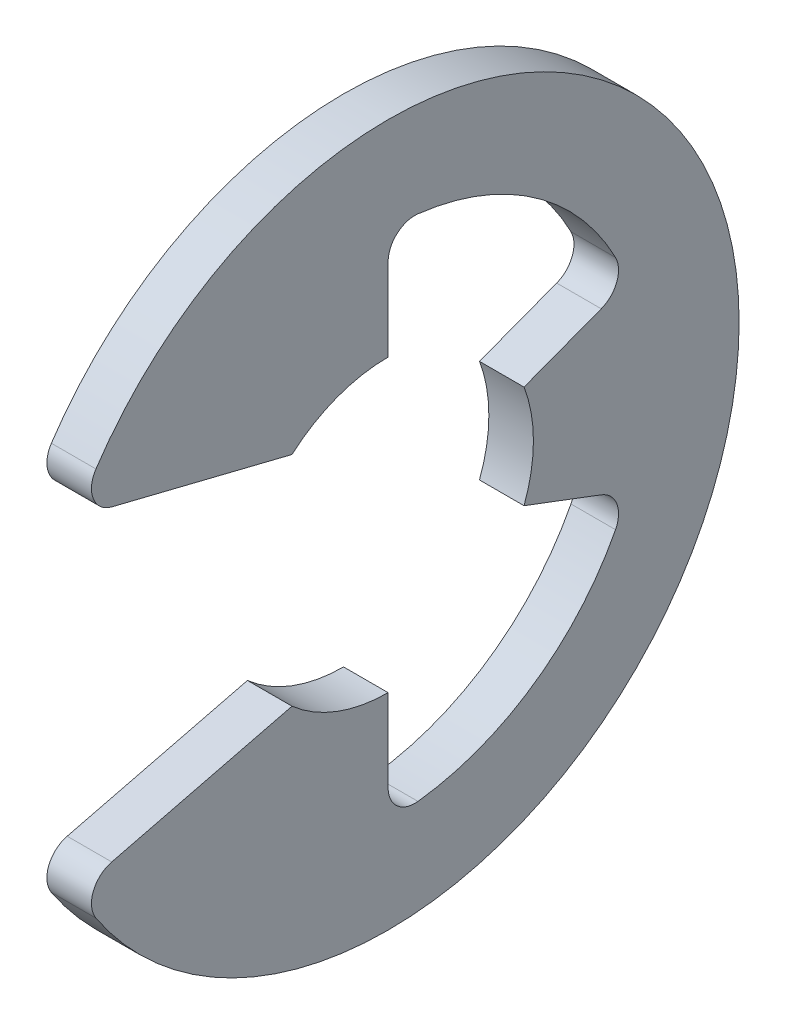
ISO-10303-21;
HEADER;
FILE_DESCRIPTION(('STEP AP214'),'2;1');
FILE_NAME('part.step','',(''),(''),'','','');
FILE_SCHEMA(('AUTOMOTIVE_DESIGN { 1 0 10303 214 1 1 1 1 }'));
ENDSEC;
DATA;
#1=APPLICATION_CONTEXT('core data for automotive mechanical design processes');
#2=APPLICATION_PROTOCOL_DEFINITION('international standard','automotive_design',2000,#1);
#3=PRODUCT_CONTEXT('',#1,'mechanical');
#4=PRODUCT('Part','Part','',(#3));
#5=PRODUCT_RELATED_PRODUCT_CATEGORY('part','',(#4));
#6=PRODUCT_DEFINITION_FORMATION('','',#4);
#7=PRODUCT_DEFINITION_CONTEXT('part definition',#1,'design');
#8=PRODUCT_DEFINITION('design','',#6,#7);
#9=PRODUCT_DEFINITION_SHAPE('','',#8);
#10=(LENGTH_UNIT() NAMED_UNIT(*) SI_UNIT(.MILLI.,.METRE.));
#11=(NAMED_UNIT(*) PLANE_ANGLE_UNIT() SI_UNIT($,.RADIAN.));
#12=(NAMED_UNIT(*) SI_UNIT($,.STERADIAN.) SOLID_ANGLE_UNIT());
#13=UNCERTAINTY_MEASURE_WITH_UNIT(LENGTH_MEASURE(1.E-05),#10,'distance_accuracy_value','');
#14=(GEOMETRIC_REPRESENTATION_CONTEXT(3) GLOBAL_UNCERTAINTY_ASSIGNED_CONTEXT((#13)) GLOBAL_UNIT_ASSIGNED_CONTEXT((#10,
#11,#12)) REPRESENTATION_CONTEXT('',''));
#15=CARTESIAN_POINT('',(0.,0.,0.));
#16=DIRECTION('',(0.,0.,1.));
#17=DIRECTION('',(1.,0.,0.));
#18=AXIS2_PLACEMENT_3D('',#15,#16,#17);
#19=CARTESIAN_POINT('',(0.5,0.,0.));
#20=DIRECTION('',(-1.,0.,0.));
#21=DIRECTION('',(0.,0.,1.));
#22=AXIS2_PLACEMENT_3D('',#19,#20,#21);
#23=CYLINDRICAL_SURFACE('',#22,7.87500000000001);
#24=CARTESIAN_POINT('',(0.5,0.,0.));
#25=DIRECTION('',(1.,0.,0.));
#26=DIRECTION('',(0.,0.,-1.));
#27=AXIS2_PLACEMENT_3D('',#24,#25,#26);
#28=CIRCLE('',#27,7.87500000000001);
#29=CARTESIAN_POINT('',(0.5,-4.36384197950054,6.55534195736186));
#30=VERTEX_POINT('',#29);
#31=CARTESIAN_POINT('',(0.5,4.36384197950054,6.55534195736186));
#32=VERTEX_POINT('',#31);
#33=EDGE_CURVE('E170',#30,#32,#28,.T.);
#34=ORIENTED_EDGE('',*,*,#33,.F.);
#35=DIRECTION('',(-1.,0.,0.));
#36=VECTOR('',#35,1.);
#37=CARTESIAN_POINT('',(0.5,-4.36384197950054,6.55534195736186));
#38=LINE('',#37,#36);
#39=CARTESIAN_POINT('',(-0.5,-4.36384197950054,6.55534195736186));
#40=VERTEX_POINT('',#39);
#41=EDGE_CURVE('E264',#30,#40,#38,.T.);
#42=ORIENTED_EDGE('',*,*,#41,.T.);
#43=CARTESIAN_POINT('',(-0.5,0.,0.));
#44=DIRECTION('',(1.,0.,0.));
#45=DIRECTION('',(0.,0.,-1.));
#46=AXIS2_PLACEMENT_3D('',#43,#44,#45);
#47=CIRCLE('',#46,7.87500000000001);
#48=CARTESIAN_POINT('',(-0.5,4.36384197950054,6.55534195736186));
#49=VERTEX_POINT('',#48);
#50=EDGE_CURVE('E208',#40,#49,#47,.T.);
#51=ORIENTED_EDGE('',*,*,#50,.T.);
#52=DIRECTION('',(-1.,0.,0.));
#53=VECTOR('',#52,1.);
#54=CARTESIAN_POINT('',(0.5,4.36384197950054,6.55534195736186));
#55=LINE('',#54,#53);
#56=EDGE_CURVE('E262',#49,#32,#55,.F.);
#57=ORIENTED_EDGE('',*,*,#56,.T.);
#58=EDGE_LOOP('',(#34,#42,#51,#57));
#59=FACE_BOUND('',#58,.T.);
#60=ADVANCED_FACE('F32',(#59),#23,.T.);
#61=CARTESIAN_POINT('',(0.5,3.64299487654465,6.98170561750276));
#62=DIRECTION('',(0.,0.970536829925373,-0.240952820606873));
#63=DIRECTION('',(0.,0.240952820606873,0.970536829925373));
#64=AXIS2_PLACEMENT_3D('',#61,#62,#63);
#65=PLANE('',#64);
#66=DIRECTION('',(0.,-0.240952820606873,-0.970536829925373));
#67=VECTOR('',#66,1.);
#68=CARTESIAN_POINT('',(0.5,3.64299487654465,6.98170561750276));
#69=LINE('',#68,#67);
#70=CARTESIAN_POINT('',(0.5,3.44903668310718,6.20045902440318));
#71=VERTEX_POINT('',#70);
#72=CARTESIAN_POINT('',(0.5,2.445,2.15628731851764));
#73=VERTEX_POINT('',#72);
#74=EDGE_CURVE('E156',#71,#73,#69,.T.);
#75=ORIENTED_EDGE('',*,*,#74,.F.);
#76=DIRECTION('',(-1.,0.,0.));
#77=VECTOR('',#76,1.);
#78=CARTESIAN_POINT('',(0.5,3.44903668310718,6.20045902440318));
#79=LINE('',#78,#77);
#80=CARTESIAN_POINT('',(-0.5,3.44903668310718,6.20045902440318));
#81=VERTEX_POINT('',#80);
#82=EDGE_CURVE('E276',#71,#81,#79,.T.);
#83=ORIENTED_EDGE('',*,*,#82,.T.);
#84=DIRECTION('',(0.,-0.240952820606873,-0.970536829925373));
#85=VECTOR('',#84,1.);
#86=CARTESIAN_POINT('',(-0.5,3.64299487654465,6.98170561750276));
#87=LINE('',#86,#85);
#88=CARTESIAN_POINT('',(-0.5,2.445,2.15628731851764));
#89=VERTEX_POINT('',#88);
#90=EDGE_CURVE('E176',#81,#89,#87,.T.);
#91=ORIENTED_EDGE('',*,*,#90,.T.);
#92=DIRECTION('',(-1.,0.,0.));
#93=VECTOR('',#92,1.);
#94=CARTESIAN_POINT('',(0.5,2.445,2.15628731851764));
#95=LINE('',#94,#93);
#96=EDGE_CURVE('E173',#73,#89,#95,.T.);
#97=ORIENTED_EDGE('',*,*,#96,.F.);
#98=EDGE_LOOP('',(#75,#83,#91,#97));
#99=FACE_BOUND('',#98,.T.);
#100=ADVANCED_FACE('F174',(#99),#65,.F.);
#101=CARTESIAN_POINT('',(0.5,0.,0.));
#102=DIRECTION('',(-1.,0.,0.));
#103=DIRECTION('',(0.,0.,1.));
#104=AXIS2_PLACEMENT_3D('',#101,#102,#103);
#105=CYLINDRICAL_SURFACE('',#104,3.26);
#106=CARTESIAN_POINT('',(-0.5,0.,0.));
#107=DIRECTION('',(-1.,0.,0.));
#108=DIRECTION('',(0.,0.,1.));
#109=AXIS2_PLACEMENT_3D('',#106,#107,#108);
#110=CIRCLE('',#109,3.26);
#111=CARTESIAN_POINT('',(-0.5,3.26,0.));
#112=VERTEX_POINT('',#111);
#113=EDGE_CURVE('E212',#89,#112,#110,.T.);
#114=ORIENTED_EDGE('',*,*,#113,.T.);
#115=DIRECTION('',(-1.,0.,0.));
#116=VECTOR('',#115,1.);
#117=CARTESIAN_POINT('',(0.5,3.26,0.));
#118=LINE('',#117,#116);
#119=CARTESIAN_POINT('',(0.5,3.26,0.));
#120=VERTEX_POINT('',#119);
#121=EDGE_CURVE('E180',#120,#112,#118,.T.);
#122=ORIENTED_EDGE('',*,*,#121,.F.);
#123=CARTESIAN_POINT('',(0.5,0.,0.));
#124=DIRECTION('',(-1.,0.,0.));
#125=DIRECTION('',(0.,0.,1.));
#126=AXIS2_PLACEMENT_3D('',#123,#124,#125);
#127=CIRCLE('',#126,3.26);
#128=EDGE_CURVE('E162',#73,#120,#127,.T.);
#129=ORIENTED_EDGE('',*,*,#128,.F.);
#130=ORIENTED_EDGE('',*,*,#96,.T.);
#131=EDGE_LOOP('',(#114,#122,#129,#130));
#132=FACE_BOUND('',#131,.T.);
#133=ADVANCED_FACE('F182',(#132),#105,.F.);
#134=CARTESIAN_POINT('',(0.5,3.26,0.));
#135=DIRECTION('',(0.,0.,1.));
#136=DIRECTION('',(0.,-1.,0.));
#137=AXIS2_PLACEMENT_3D('',#134,#135,#136);
#138=PLANE('',#137);
#139=DIRECTION('',(0.,1.,0.));
#140=VECTOR('',#139,1.);
#141=CARTESIAN_POINT('',(-0.5,3.26,0.));
#142=LINE('',#141,#140);
#143=CARTESIAN_POINT('',(-0.5,5.11200598619697,0.));
#144=VERTEX_POINT('',#143);
#145=EDGE_CURVE('E214',#112,#144,#142,.T.);
#146=ORIENTED_EDGE('',*,*,#145,.T.);
#147=DIRECTION('',(1.,0.,0.));
#148=VECTOR('',#147,1.);
#149=CARTESIAN_POINT('',(0.5,5.11200598619697,0.));
#150=LINE('',#149,#148);
#151=CARTESIAN_POINT('',(0.5,5.11200598619697,0.));
#152=VERTEX_POINT('',#151);
#153=EDGE_CURVE('E260',#144,#152,#150,.T.);
#154=ORIENTED_EDGE('',*,*,#153,.T.);
#155=DIRECTION('',(0.,1.,0.));
#156=VECTOR('',#155,1.);
#157=CARTESIAN_POINT('',(0.5,3.26,0.));
#158=LINE('',#157,#156);
#159=EDGE_CURVE('E185',#120,#152,#158,.T.);
#160=ORIENTED_EDGE('',*,*,#159,.F.);
#161=ORIENTED_EDGE('',*,*,#121,.T.);
#162=EDGE_LOOP('',(#146,#154,#160,#161));
#163=FACE_BOUND('',#162,.T.);
#164=ADVANCED_FACE('F382',(#163),#138,.F.);
#165=CARTESIAN_POINT('',(0.5,0.,0.));
#166=DIRECTION('',(-1.,0.,0.));
#167=DIRECTION('',(0.,0.,1.));
#168=AXIS2_PLACEMENT_3D('',#165,#166,#167);
#169=CYLINDRICAL_SURFACE('',#168,5.74709677419355);
#170=CARTESIAN_POINT('',(0.5,0.,0.));
#171=DIRECTION('',(-1.,0.,0.));
#172=DIRECTION('',(0.,0.,-1.));
#173=AXIS2_PLACEMENT_3D('',#170,#171,#172);
#174=CIRCLE('',#173,5.74709677419355);
#175=CARTESIAN_POINT('',(0.5,5.70791543307127,-0.669942341438955));
#176=VERTEX_POINT('',#175);
#177=CARTESIAN_POINT('',(0.5,2.64472653222145,-5.10240559949028));
#178=VERTEX_POINT('',#177);
#179=EDGE_CURVE('E187',#176,#178,#174,.T.);
#180=ORIENTED_EDGE('',*,*,#179,.F.);
#181=DIRECTION('',(-1.,0.,0.));
#182=VECTOR('',#181,1.);
#183=CARTESIAN_POINT('',(0.5,5.70791543307127,-0.669942341438955));
#184=LINE('',#183,#182);
#185=CARTESIAN_POINT('',(-0.5,5.70791543307127,-0.669942341438955));
#186=VERTEX_POINT('',#185);
#187=EDGE_CURVE('E257',#176,#186,#184,.T.);
#188=ORIENTED_EDGE('',*,*,#187,.T.);
#189=CARTESIAN_POINT('',(-0.5,0.,0.));
#190=DIRECTION('',(-1.,0.,0.));
#191=DIRECTION('',(0.,0.,-1.));
#192=AXIS2_PLACEMENT_3D('',#189,#190,#191);
#193=CIRCLE('',#192,5.74709677419355);
#194=CARTESIAN_POINT('',(-0.5,2.64472653222145,-5.10240559949028));
#195=VERTEX_POINT('',#194);
#196=EDGE_CURVE('E217',#186,#195,#193,.T.);
#197=ORIENTED_EDGE('',*,*,#196,.T.);
#198=DIRECTION('',(-1.,0.,0.));
#199=VECTOR('',#198,1.);
#200=CARTESIAN_POINT('',(0.5,2.64472653222145,-5.10240559949029));
#201=LINE('',#200,#199);
#202=EDGE_CURVE('E255',#195,#178,#201,.F.);
#203=ORIENTED_EDGE('',*,*,#202,.T.);
#204=EDGE_LOOP('',(#180,#188,#197,#203));
#205=FACE_BOUND('',#204,.T.);
#206=ADVANCED_FACE('F304',(#205),#169,.F.);
#207=CARTESIAN_POINT('',(0.5,1.15258405333407,-3.04945077022076));
#208=DIRECTION('',(0.,-0.935414346693485,-0.353553390593274));
#209=DIRECTION('',(0.,0.353553390593274,-0.935414346693485));
#210=AXIS2_PLACEMENT_3D('',#207,#208,#209);
#211=PLANE('',#210);
#212=DIRECTION('',(0.,-0.353553390593274,0.935414346693485));
#213=VECTOR('',#212,1.);
#214=CARTESIAN_POINT('',(0.5,1.15258405333407,-3.04945077022076));
#215=LINE('',#214,#213);
#216=CARTESIAN_POINT('',(0.5,1.80736704915305,-4.78184373987162));
#217=VERTEX_POINT('',#216);
#218=CARTESIAN_POINT('',(0.5,1.15258405333407,-3.04945077022076));
#219=VERTEX_POINT('',#218);
#220=EDGE_CURVE('E192',#217,#219,#215,.T.);
#221=ORIENTED_EDGE('',*,*,#220,.F.);
#222=DIRECTION('',(1.,0.,0.));
#223=VECTOR('',#222,1.);
#224=CARTESIAN_POINT('',(-0.5,1.80736704915305,-4.78184373987162));
#225=LINE('',#224,#223);
#226=CARTESIAN_POINT('',(-0.5,1.80736704915305,-4.78184373987162));
#227=VERTEX_POINT('',#226);
#228=EDGE_CURVE('E279',#217,#227,#225,.F.);
#229=ORIENTED_EDGE('',*,*,#228,.T.);
#230=DIRECTION('',(0.,-0.353553390593274,0.935414346693485));
#231=VECTOR('',#230,1.);
#232=CARTESIAN_POINT('',(-0.5,1.15258405333407,-3.04945077022076));
#233=LINE('',#232,#231);
#234=CARTESIAN_POINT('',(-0.5,1.15258405333407,-3.04945077022076));
#235=VERTEX_POINT('',#234);
#236=EDGE_CURVE('E220',#227,#235,#233,.T.);
#237=ORIENTED_EDGE('',*,*,#236,.T.);
#238=DIRECTION('',(-1.,0.,0.));
#239=VECTOR('',#238,1.);
#240=CARTESIAN_POINT('',(0.5,1.15258405333407,-3.04945077022076));
#241=LINE('',#240,#239);
#242=EDGE_CURVE('E244',#219,#235,#241,.T.);
#243=ORIENTED_EDGE('',*,*,#242,.F.);
#244=EDGE_LOOP('',(#221,#229,#237,#243));
#245=FACE_BOUND('',#244,.T.);
#246=ADVANCED_FACE('F307',(#245),#211,.F.);
#247=CARTESIAN_POINT('',(0.5,0.,0.));
#248=DIRECTION('',(-1.,0.,0.));
#249=DIRECTION('',(0.,0.,1.));
#250=AXIS2_PLACEMENT_3D('',#247,#248,#249);
#251=CYLINDRICAL_SURFACE('',#250,3.26);
#252=CARTESIAN_POINT('',(-0.5,0.,0.));
#253=DIRECTION('',(-1.,0.,0.));
#254=DIRECTION('',(0.,0.,1.));
#255=AXIS2_PLACEMENT_3D('',#252,#253,#254);
#256=CIRCLE('',#255,3.26);
#257=CARTESIAN_POINT('',(-0.5,-1.15258405333407,-3.04945077022076));
#258=VERTEX_POINT('',#257);
#259=EDGE_CURVE('E222',#235,#258,#256,.T.);
#260=ORIENTED_EDGE('',*,*,#259,.T.);
#261=DIRECTION('',(-1.,0.,0.));
#262=VECTOR('',#261,1.);
#263=CARTESIAN_POINT('',(0.5,-1.15258405333407,-3.04945077022076));
#264=LINE('',#263,#262);
#265=CARTESIAN_POINT('',(0.5,-1.15258405333407,-3.04945077022076));
#266=VERTEX_POINT('',#265);
#267=EDGE_CURVE('E241',#266,#258,#264,.T.);
#268=ORIENTED_EDGE('',*,*,#267,.F.);
#269=CARTESIAN_POINT('',(0.5,0.,0.));
#270=DIRECTION('',(-1.,0.,0.));
#271=DIRECTION('',(0.,0.,1.));
#272=AXIS2_PLACEMENT_3D('',#269,#270,#271);
#273=CIRCLE('',#272,3.26);
#274=EDGE_CURVE('E194',#219,#266,#273,.T.);
#275=ORIENTED_EDGE('',*,*,#274,.F.);
#276=ORIENTED_EDGE('',*,*,#242,.T.);
#277=EDGE_LOOP('',(#260,#268,#275,#276));
#278=FACE_BOUND('',#277,.T.);
#279=ADVANCED_FACE('F313',(#278),#251,.F.);
#280=CARTESIAN_POINT('',(0.5,-1.15258405333407,-3.04945077022076));
#281=DIRECTION('',(0.,0.935414346693485,-0.353553390593274));
#282=DIRECTION('',(0.,0.353553390593274,0.935414346693485));
#283=AXIS2_PLACEMENT_3D('',#280,#281,#282);
#284=PLANE('',#283);
#285=DIRECTION('',(0.,-0.353553390593274,-0.935414346693485));
#286=VECTOR('',#285,1.);
#287=CARTESIAN_POINT('',(-0.5,-1.15258405333407,-3.04945077022076));
#288=LINE('',#287,#286);
#289=CARTESIAN_POINT('',(-0.5,-1.80736704915305,-4.78184373987162));
#290=VERTEX_POINT('',#289);
#291=EDGE_CURVE('E224',#258,#290,#288,.T.);
#292=ORIENTED_EDGE('',*,*,#291,.T.);
#293=DIRECTION('',(1.,0.,0.));
#294=VECTOR('',#293,1.);
#295=CARTESIAN_POINT('',(0.5,-1.80736704915305,-4.78184373987162));
#296=LINE('',#295,#294);
#297=CARTESIAN_POINT('',(0.5,-1.80736704915305,-4.78184373987162));
#298=VERTEX_POINT('',#297);
#299=EDGE_CURVE('E47',#290,#298,#296,.T.);
#300=ORIENTED_EDGE('',*,*,#299,.T.);
#301=DIRECTION('',(0.,-0.353553390593274,-0.935414346693485));
#302=VECTOR('',#301,1.);
#303=CARTESIAN_POINT('',(0.5,-1.15258405333407,-3.04945077022076));
#304=LINE('',#303,#302);
#305=EDGE_CURVE('E196',#266,#298,#304,.T.);
#306=ORIENTED_EDGE('',*,*,#305,.F.);
#307=ORIENTED_EDGE('',*,*,#267,.T.);
#308=EDGE_LOOP('',(#292,#300,#306,#307));
#309=FACE_BOUND('',#308,.T.);
#310=ADVANCED_FACE('F315',(#309),#284,.F.);
#311=CARTESIAN_POINT('',(0.5,0.,0.));
#312=DIRECTION('',(-1.,0.,0.));
#313=DIRECTION('',(0.,0.,1.));
#314=AXIS2_PLACEMENT_3D('',#311,#312,#313);
#315=CYLINDRICAL_SURFACE('',#314,5.74709677419355);
#316=CARTESIAN_POINT('',(-0.5,0.,0.));
#317=DIRECTION('',(-1.,0.,0.));
#318=DIRECTION('',(0.,0.,-1.));
#319=AXIS2_PLACEMENT_3D('',#316,#317,#318);
#320=CIRCLE('',#319,5.74709677419355);
#321=CARTESIAN_POINT('',(-0.5,-2.64472653222145,-5.10240559949029));
#322=VERTEX_POINT('',#321);
#323=CARTESIAN_POINT('',(-0.5,-5.70791543307127,-0.669942341438956));
#324=VERTEX_POINT('',#323);
#325=EDGE_CURVE('E226',#322,#324,#320,.T.);
#326=ORIENTED_EDGE('',*,*,#325,.T.);
#327=DIRECTION('',(-1.,0.,0.));
#328=VECTOR('',#327,1.);
#329=CARTESIAN_POINT('',(0.5,-5.70791543307127,-0.669942341438956));
#330=LINE('',#329,#328);
#331=CARTESIAN_POINT('',(0.5,-5.70791543307127,-0.669942341438956));
#332=VERTEX_POINT('',#331);
#333=EDGE_CURVE('E253',#324,#332,#330,.F.);
#334=ORIENTED_EDGE('',*,*,#333,.T.);
#335=CARTESIAN_POINT('',(0.5,0.,0.));
#336=DIRECTION('',(-1.,0.,0.));
#337=DIRECTION('',(0.,0.,-1.));
#338=AXIS2_PLACEMENT_3D('',#335,#336,#337);
#339=CIRCLE('',#338,5.74709677419355);
#340=CARTESIAN_POINT('',(0.5,-2.64472653222145,-5.10240559949029));
#341=VERTEX_POINT('',#340);
#342=EDGE_CURVE('E198',#341,#332,#339,.T.);
#343=ORIENTED_EDGE('',*,*,#342,.F.);
#344=DIRECTION('',(-1.,0.,0.));
#345=VECTOR('',#344,1.);
#346=CARTESIAN_POINT('',(0.5,-2.64472653222145,-5.10240559949029));
#347=LINE('',#346,#345);
#348=EDGE_CURVE('E250',#341,#322,#347,.T.);
#349=ORIENTED_EDGE('',*,*,#348,.T.);
#350=EDGE_LOOP('',(#326,#334,#343,#349));
#351=FACE_BOUND('',#350,.T.);
#352=ADVANCED_FACE('F317',(#351),#315,.F.);
#353=CARTESIAN_POINT('',(0.5,-3.26,0.));
#354=DIRECTION('',(0.,0.,1.));
#355=DIRECTION('',(0.,-1.,0.));
#356=AXIS2_PLACEMENT_3D('',#353,#354,#355);
#357=PLANE('',#356);
#358=DIRECTION('',(0.,1.,0.));
#359=VECTOR('',#358,1.);
#360=CARTESIAN_POINT('',(0.5,-3.26,0.));
#361=LINE('',#360,#359);
#362=CARTESIAN_POINT('',(0.5,-5.11200598619697,0.));
#363=VERTEX_POINT('',#362);
#364=CARTESIAN_POINT('',(0.5,-3.26,0.));
#365=VERTEX_POINT('',#364);
#366=EDGE_CURVE('E201',#363,#365,#361,.T.);
#367=ORIENTED_EDGE('',*,*,#366,.F.);
#368=DIRECTION('',(1.,0.,0.));
#369=VECTOR('',#368,1.);
#370=CARTESIAN_POINT('',(-0.5,-5.11200598619697,0.));
#371=LINE('',#370,#369);
#372=CARTESIAN_POINT('',(-0.5,-5.11200598619697,0.));
#373=VERTEX_POINT('',#372);
#374=EDGE_CURVE('E179',#363,#373,#371,.F.);
#375=ORIENTED_EDGE('',*,*,#374,.T.);
#376=DIRECTION('',(0.,1.,0.));
#377=VECTOR('',#376,1.);
#378=CARTESIAN_POINT('',(-0.5,-3.26,0.));
#379=LINE('',#378,#377);
#380=CARTESIAN_POINT('',(-0.5,-3.26,0.));
#381=VERTEX_POINT('',#380);
#382=EDGE_CURVE('E229',#373,#381,#379,.T.);
#383=ORIENTED_EDGE('',*,*,#382,.T.);
#384=DIRECTION('',(-1.,0.,0.));
#385=VECTOR('',#384,1.);
#386=CARTESIAN_POINT('',(0.5,-3.26,0.));
#387=LINE('',#386,#385);
#388=EDGE_CURVE('E238',#365,#381,#387,.T.);
#389=ORIENTED_EDGE('',*,*,#388,.F.);
#390=EDGE_LOOP('',(#367,#375,#383,#389));
#391=FACE_BOUND('',#390,.T.);
#392=ADVANCED_FACE('F323',(#391),#357,.F.);
#393=CARTESIAN_POINT('',(0.5,0.,0.));
#394=DIRECTION('',(-1.,0.,0.));
#395=DIRECTION('',(0.,0.,1.));
#396=AXIS2_PLACEMENT_3D('',#393,#394,#395);
#397=CYLINDRICAL_SURFACE('',#396,3.26);
#398=CARTESIAN_POINT('',(-0.5,0.,0.));
#399=DIRECTION('',(-1.,0.,0.));
#400=DIRECTION('',(0.,0.,-1.));
#401=AXIS2_PLACEMENT_3D('',#398,#399,#400);
#402=CIRCLE('',#401,3.26);
#403=CARTESIAN_POINT('',(-0.5,-2.445,2.15628731851764));
#404=VERTEX_POINT('',#403);
#405=EDGE_CURVE('E231',#381,#404,#402,.T.);
#406=ORIENTED_EDGE('',*,*,#405,.T.);
#407=DIRECTION('',(-1.,0.,0.));
#408=VECTOR('',#407,1.);
#409=CARTESIAN_POINT('',(0.5,-2.445,2.15628731851764));
#410=LINE('',#409,#408);
#411=CARTESIAN_POINT('',(0.5,-2.445,2.15628731851764));
#412=VERTEX_POINT('',#411);
#413=EDGE_CURVE('E207',#412,#404,#410,.T.);
#414=ORIENTED_EDGE('',*,*,#413,.F.);
#415=CARTESIAN_POINT('',(0.5,0.,0.));
#416=DIRECTION('',(-1.,0.,0.));
#417=DIRECTION('',(0.,0.,-1.));
#418=AXIS2_PLACEMENT_3D('',#415,#416,#417);
#419=CIRCLE('',#418,3.26);
#420=EDGE_CURVE('E203',#365,#412,#419,.T.);
#421=ORIENTED_EDGE('',*,*,#420,.F.);
#422=ORIENTED_EDGE('',*,*,#388,.T.);
#423=EDGE_LOOP('',(#406,#414,#421,#422));
#424=FACE_BOUND('',#423,.T.);
#425=ADVANCED_FACE('F372',(#424),#397,.F.);
#426=CARTESIAN_POINT('',(0.5,-3.64299487654465,6.98170561750275));
#427=DIRECTION('',(0.,-0.970536829925373,-0.240952820606873));
#428=DIRECTION('',(0.,0.240952820606873,-0.970536829925373));
#429=AXIS2_PLACEMENT_3D('',#426,#427,#428);
#430=PLANE('',#429);
#431=DIRECTION('',(0.,-0.240952820606873,0.970536829925373));
#432=VECTOR('',#431,1.);
#433=CARTESIAN_POINT('',(-0.5,-3.64299487654465,6.98170561750275));
#434=LINE('',#433,#432);
#435=CARTESIAN_POINT('',(-0.5,-3.44903668310718,6.20045902440318));
#436=VERTEX_POINT('',#435);
#437=EDGE_CURVE('E233',#404,#436,#434,.T.);
#438=ORIENTED_EDGE('',*,*,#437,.T.);
#439=DIRECTION('',(-1.,0.,0.));
#440=VECTOR('',#439,1.);
#441=CARTESIAN_POINT('',(0.5,-3.44903668310718,6.20045902440318));
#442=LINE('',#441,#440);
#443=CARTESIAN_POINT('',(0.5,-3.44903668310718,6.20045902440318));
#444=VERTEX_POINT('',#443);
#445=EDGE_CURVE('E271',#436,#444,#442,.F.);
#446=ORIENTED_EDGE('',*,*,#445,.T.);
#447=DIRECTION('',(0.,-0.240952820606873,0.970536829925373));
#448=VECTOR('',#447,1.);
#449=CARTESIAN_POINT('',(0.5,-3.64299487654465,6.98170561750275));
#450=LINE('',#449,#448);
#451=EDGE_CURVE('E205',#412,#444,#450,.T.);
#452=ORIENTED_EDGE('',*,*,#451,.F.);
#453=ORIENTED_EDGE('',*,*,#413,.T.);
#454=EDGE_LOOP('',(#438,#446,#452,#453));
#455=FACE_BOUND('',#454,.T.);
#456=ADVANCED_FACE('F414',(#455),#430,.F.);
#457=CARTESIAN_POINT('',(0.5,0.,0.));
#458=DIRECTION('',(1.,0.,0.));
#459=DIRECTION('',(0.,0.,-1.));
#460=AXIS2_PLACEMENT_3D('',#457,#458,#459);
#461=PLANE('',#460);
#462=ORIENTED_EDGE('',*,*,#451,.T.);
#463=CARTESIAN_POINT('',(0.5,-4.03135878106241,6.05588733203906));
#464=DIRECTION('',(1.,0.,0.));
#465=DIRECTION('',(0.,0.,-1.));
#466=AXIS2_PLACEMENT_3D('',#463,#464,#465);
#467=CIRCLE('',#466,0.6);
#468=EDGE_CURVE('E274',#444,#30,#467,.T.);
#469=ORIENTED_EDGE('',*,*,#468,.T.);
#470=ORIENTED_EDGE('',*,*,#33,.T.);
#471=CARTESIAN_POINT('',(0.5,4.0313587810624,6.05588733203906));
#472=DIRECTION('',(1.,0.,0.));
#473=DIRECTION('',(0.,0.,-1.));
#474=AXIS2_PLACEMENT_3D('',#471,#472,#473);
#475=CIRCLE('',#474,0.6);
#476=EDGE_CURVE('E166',#32,#71,#475,.T.);
#477=ORIENTED_EDGE('',*,*,#476,.T.);
#478=ORIENTED_EDGE('',*,*,#74,.T.);
#479=ORIENTED_EDGE('',*,*,#128,.T.);
#480=ORIENTED_EDGE('',*,*,#159,.T.);
#481=CARTESIAN_POINT('',(0.5,5.11200598619697,-0.599999999999998));
#482=DIRECTION('',(1.,0.,0.));
#483=DIRECTION('',(0.,0.,-1.));
#484=AXIS2_PLACEMENT_3D('',#481,#482,#483);
#485=CIRCLE('',#484,0.6);
#486=EDGE_CURVE('E288',#152,#176,#485,.F.);
#487=ORIENTED_EDGE('',*,*,#486,.T.);
#488=ORIENTED_EDGE('',*,*,#179,.T.);
#489=CARTESIAN_POINT('',(0.5,2.36861565716914,-4.56971170551566));
#490=DIRECTION('',(1.,0.,0.));
#491=DIRECTION('',(0.,0.,-1.));
#492=AXIS2_PLACEMENT_3D('',#489,#490,#491);
#493=CIRCLE('',#492,0.6);
#494=EDGE_CURVE('E11',#178,#217,#493,.F.);
#495=ORIENTED_EDGE('',*,*,#494,.T.);
#496=ORIENTED_EDGE('',*,*,#220,.T.);
#497=ORIENTED_EDGE('',*,*,#274,.T.);
#498=ORIENTED_EDGE('',*,*,#305,.T.);
#499=CARTESIAN_POINT('',(0.5,-2.36861565716914,-4.56971170551566));
#500=DIRECTION('',(1.,0.,0.));
#501=DIRECTION('',(0.,0.,-1.));
#502=AXIS2_PLACEMENT_3D('',#499,#500,#501);
#503=CIRCLE('',#502,0.6);
#504=EDGE_CURVE('E292',#298,#341,#503,.F.);
#505=ORIENTED_EDGE('',*,*,#504,.T.);
#506=ORIENTED_EDGE('',*,*,#342,.T.);
#507=CARTESIAN_POINT('',(0.5,-5.11200598619697,-0.599999999999999));
#508=DIRECTION('',(1.,0.,0.));
#509=DIRECTION('',(0.,0.,-1.));
#510=AXIS2_PLACEMENT_3D('',#507,#508,#509);
#511=CIRCLE('',#510,0.6);
#512=EDGE_CURVE('E284',#332,#363,#511,.F.);
#513=ORIENTED_EDGE('',*,*,#512,.T.);
#514=ORIENTED_EDGE('',*,*,#366,.T.);
#515=ORIENTED_EDGE('',*,*,#420,.T.);
#516=EDGE_LOOP('',(#462,#469,#470,#477,#478,#479,#480,#487,#488,#495,#496,#497,#498,#505,#506,
#513,#514,#515));
#517=FACE_BOUND('',#516,.T.);
#518=ADVANCED_FACE('F159',(#517),#461,.T.);
#519=CARTESIAN_POINT('',(-0.5,0.,0.));
#520=DIRECTION('',(1.,0.,0.));
#521=DIRECTION('',(0.,0.,-1.));
#522=AXIS2_PLACEMENT_3D('',#519,#520,#521);
#523=PLANE('',#522);
#524=ORIENTED_EDGE('',*,*,#50,.F.);
#525=CARTESIAN_POINT('',(-0.5,-4.03135878106241,6.05588733203906));
#526=DIRECTION('',(1.,0.,0.));
#527=DIRECTION('',(0.,0.,-1.));
#528=AXIS2_PLACEMENT_3D('',#525,#526,#527);
#529=CIRCLE('',#528,0.6);
#530=EDGE_CURVE('E269',#40,#436,#529,.F.);
#531=ORIENTED_EDGE('',*,*,#530,.T.);
#532=ORIENTED_EDGE('',*,*,#437,.F.);
#533=ORIENTED_EDGE('',*,*,#405,.F.);
#534=ORIENTED_EDGE('',*,*,#382,.F.);
#535=CARTESIAN_POINT('',(-0.5,-5.11200598619697,-0.599999999999999));
#536=DIRECTION('',(1.,0.,0.));
#537=DIRECTION('',(0.,0.,-1.));
#538=AXIS2_PLACEMENT_3D('',#535,#536,#537);
#539=CIRCLE('',#538,0.6);
#540=EDGE_CURVE('E282',#373,#324,#539,.T.);
#541=ORIENTED_EDGE('',*,*,#540,.T.);
#542=ORIENTED_EDGE('',*,*,#325,.F.);
#543=CARTESIAN_POINT('',(-0.5,-2.36861565716914,-4.56971170551566));
#544=DIRECTION('',(1.,0.,0.));
#545=DIRECTION('',(0.,0.,-1.));
#546=AXIS2_PLACEMENT_3D('',#543,#544,#545);
#547=CIRCLE('',#546,0.6);
#548=EDGE_CURVE('E290',#322,#290,#547,.T.);
#549=ORIENTED_EDGE('',*,*,#548,.T.);
#550=ORIENTED_EDGE('',*,*,#291,.F.);
#551=ORIENTED_EDGE('',*,*,#259,.F.);
#552=ORIENTED_EDGE('',*,*,#236,.F.);
#553=CARTESIAN_POINT('',(-0.5,2.36861565716914,-4.56971170551566));
#554=DIRECTION('',(1.,0.,0.));
#555=DIRECTION('',(0.,0.,-1.));
#556=AXIS2_PLACEMENT_3D('',#553,#554,#555);
#557=CIRCLE('',#556,0.6);
#558=EDGE_CURVE('E40',#227,#195,#557,.T.);
#559=ORIENTED_EDGE('',*,*,#558,.T.);
#560=ORIENTED_EDGE('',*,*,#196,.F.);
#561=CARTESIAN_POINT('',(-0.5,5.11200598619697,-0.599999999999998));
#562=DIRECTION('',(1.,0.,0.));
#563=DIRECTION('',(0.,0.,-1.));
#564=AXIS2_PLACEMENT_3D('',#561,#562,#563);
#565=CIRCLE('',#564,0.6);
#566=EDGE_CURVE('E286',#186,#144,#565,.T.);
#567=ORIENTED_EDGE('',*,*,#566,.T.);
#568=ORIENTED_EDGE('',*,*,#145,.F.);
#569=ORIENTED_EDGE('',*,*,#113,.F.);
#570=ORIENTED_EDGE('',*,*,#90,.F.);
#571=CARTESIAN_POINT('',(-0.5,4.0313587810624,6.05588733203906));
#572=DIRECTION('',(1.,0.,0.));
#573=DIRECTION('',(0.,0.,-1.));
#574=AXIS2_PLACEMENT_3D('',#571,#572,#573);
#575=CIRCLE('',#574,0.6);
#576=EDGE_CURVE('E267',#81,#49,#575,.F.);
#577=ORIENTED_EDGE('',*,*,#576,.T.);
#578=EDGE_LOOP('',(#524,#531,#532,#533,#534,#541,#542,#549,#550,#551,#552,#559,#560,#567,#568,
#569,#570,#577));
#579=FACE_BOUND('',#578,.T.);
#580=ADVANCED_FACE('F297',(#579),#523,.F.);
#581=CARTESIAN_POINT('',(0.5,-5.11200598619697,-0.599999999999999));
#582=DIRECTION('',(-1.,0.,0.));
#583=DIRECTION('',(0.,0.,1.));
#584=AXIS2_PLACEMENT_3D('',#581,#582,#583);
#585=CYLINDRICAL_SURFACE('',#584,0.6);
#586=ORIENTED_EDGE('',*,*,#512,.F.);
#587=ORIENTED_EDGE('',*,*,#333,.F.);
#588=ORIENTED_EDGE('',*,*,#540,.F.);
#589=ORIENTED_EDGE('',*,*,#374,.F.);
#590=EDGE_LOOP('',(#586,#587,#588,#589));
#591=FACE_BOUND('',#590,.T.);
#592=ADVANCED_FACE('F337',(#591),#585,.F.);
#593=CARTESIAN_POINT('',(0.5,5.11200598619697,-0.599999999999998));
#594=DIRECTION('',(-1.,0.,0.));
#595=DIRECTION('',(0.,0.,1.));
#596=AXIS2_PLACEMENT_3D('',#593,#594,#595);
#597=CYLINDRICAL_SURFACE('',#596,0.6);
#598=ORIENTED_EDGE('',*,*,#486,.F.);
#599=ORIENTED_EDGE('',*,*,#153,.F.);
#600=ORIENTED_EDGE('',*,*,#566,.F.);
#601=ORIENTED_EDGE('',*,*,#187,.F.);
#602=EDGE_LOOP('',(#598,#599,#600,#601));
#603=FACE_BOUND('',#602,.T.);
#604=ADVANCED_FACE('F340',(#603),#597,.F.);
#605=CARTESIAN_POINT('',(0.5,-4.03135878106241,6.05588733203906));
#606=DIRECTION('',(-1.,0.,0.));
#607=DIRECTION('',(0.,0.,1.));
#608=AXIS2_PLACEMENT_3D('',#605,#606,#607);
#609=CYLINDRICAL_SURFACE('',#608,0.6);
#610=ORIENTED_EDGE('',*,*,#468,.F.);
#611=ORIENTED_EDGE('',*,*,#445,.F.);
#612=ORIENTED_EDGE('',*,*,#530,.F.);
#613=ORIENTED_EDGE('',*,*,#41,.F.);
#614=EDGE_LOOP('',(#610,#611,#612,#613));
#615=FACE_BOUND('',#614,.T.);
#616=ADVANCED_FACE('F344',(#615),#609,.T.);
#617=CARTESIAN_POINT('',(0.5,4.0313587810624,6.05588733203906));
#618=DIRECTION('',(-1.,0.,0.));
#619=DIRECTION('',(0.,0.,1.));
#620=AXIS2_PLACEMENT_3D('',#617,#618,#619);
#621=CYLINDRICAL_SURFACE('',#620,0.6);
#622=ORIENTED_EDGE('',*,*,#476,.F.);
#623=ORIENTED_EDGE('',*,*,#56,.F.);
#624=ORIENTED_EDGE('',*,*,#576,.F.);
#625=ORIENTED_EDGE('',*,*,#82,.F.);
#626=EDGE_LOOP('',(#622,#623,#624,#625));
#627=FACE_BOUND('',#626,.T.);
#628=ADVANCED_FACE('F348',(#627),#621,.T.);
#629=CARTESIAN_POINT('',(0.5,-2.36861565716914,-4.56971170551566));
#630=DIRECTION('',(-1.,0.,0.));
#631=DIRECTION('',(0.,0.,1.));
#632=AXIS2_PLACEMENT_3D('',#629,#630,#631);
#633=CYLINDRICAL_SURFACE('',#632,0.6);
#634=ORIENTED_EDGE('',*,*,#504,.F.);
#635=ORIENTED_EDGE('',*,*,#299,.F.);
#636=ORIENTED_EDGE('',*,*,#548,.F.);
#637=ORIENTED_EDGE('',*,*,#348,.F.);
#638=EDGE_LOOP('',(#634,#635,#636,#637));
#639=FACE_BOUND('',#638,.T.);
#640=ADVANCED_FACE('F351',(#639),#633,.F.);
#641=CARTESIAN_POINT('',(0.5,2.36861565716914,-4.56971170551566));
#642=DIRECTION('',(-1.,0.,0.));
#643=DIRECTION('',(0.,0.,1.));
#644=AXIS2_PLACEMENT_3D('',#641,#642,#643);
#645=CYLINDRICAL_SURFACE('',#644,0.6);
#646=ORIENTED_EDGE('',*,*,#494,.F.);
#647=ORIENTED_EDGE('',*,*,#202,.F.);
#648=ORIENTED_EDGE('',*,*,#558,.F.);
#649=ORIENTED_EDGE('',*,*,#228,.F.);
#650=EDGE_LOOP('',(#646,#647,#648,#649));
#651=FACE_BOUND('',#650,.T.);
#652=ADVANCED_FACE('F34',(#651),#645,.F.);
#653=CLOSED_SHELL('',(#60,#100,#133,#164,#206,#246,#279,#310,#352,#392,#425,#456,#518,#580,#592,
#604,#616,#628,#640,#652));
#654=MANIFOLD_SOLID_BREP('B2',#653);
#655=ADVANCED_BREP_SHAPE_REPRESENTATION('',(#18,#654),#14);
#656=SHAPE_DEFINITION_REPRESENTATION(#9,#655);
ENDSEC;
END-ISO-10303-21;
